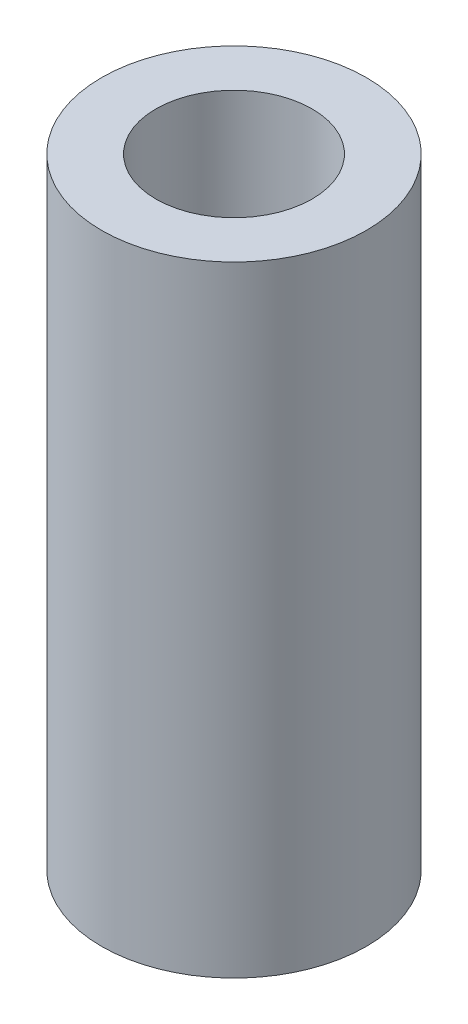
ISO-10303-21;
HEADER;
FILE_DESCRIPTION(('STEP AP214'),'2;1');
FILE_NAME('part.step','',(''),(''),'','','');
FILE_SCHEMA(('AUTOMOTIVE_DESIGN { 1 0 10303 214 1 1 1 1 }'));
ENDSEC;
DATA;
#1=APPLICATION_CONTEXT('core data for automotive mechanical design processes');
#2=APPLICATION_PROTOCOL_DEFINITION('international standard','automotive_design',2000,#1);
#3=PRODUCT_CONTEXT('',#1,'mechanical');
#4=PRODUCT('Part','Part','',(#3));
#5=PRODUCT_RELATED_PRODUCT_CATEGORY('part','',(#4));
#6=PRODUCT_DEFINITION_FORMATION('','',#4);
#7=PRODUCT_DEFINITION_CONTEXT('part definition',#1,'design');
#8=PRODUCT_DEFINITION('design','',#6,#7);
#9=PRODUCT_DEFINITION_SHAPE('','',#8);
#10=(LENGTH_UNIT() NAMED_UNIT(*) SI_UNIT(.MILLI.,.METRE.));
#11=(NAMED_UNIT(*) PLANE_ANGLE_UNIT() SI_UNIT($,.RADIAN.));
#12=(NAMED_UNIT(*) SI_UNIT($,.STERADIAN.) SOLID_ANGLE_UNIT());
#13=UNCERTAINTY_MEASURE_WITH_UNIT(LENGTH_MEASURE(1.E-05),#10,'distance_accuracy_value','');
#14=(GEOMETRIC_REPRESENTATION_CONTEXT(3) GLOBAL_UNCERTAINTY_ASSIGNED_CONTEXT((#13)) GLOBAL_UNIT_ASSIGNED_CONTEXT((#10,
#11,#12)) REPRESENTATION_CONTEXT('',''));
#15=CARTESIAN_POINT('',(0.,0.,0.));
#16=DIRECTION('',(0.,0.,1.));
#17=DIRECTION('',(1.,0.,0.));
#18=AXIS2_PLACEMENT_3D('',#15,#16,#17);
#19=CARTESIAN_POINT('',(0.,28.575,0.));
#20=DIRECTION('',(0.,1.,0.));
#21=DIRECTION('',(0.,0.,1.));
#22=AXIS2_PLACEMENT_3D('',#19,#20,#21);
#23=PLANE('',#22);
#24=CARTESIAN_POINT('',(0.,28.575,0.));
#25=DIRECTION('',(0.,1.,0.));
#26=DIRECTION('',(0.,0.,1.));
#27=AXIS2_PLACEMENT_3D('',#24,#25,#26);
#28=CIRCLE('',#27,6.1);
#29=CARTESIAN_POINT('',(0.,28.575,6.1));
#30=VERTEX_POINT('',#29);
#31=EDGE_CURVE('E10',#30,#30,#28,.T.);
#32=ORIENTED_EDGE('',*,*,#31,.T.);
#33=EDGE_LOOP('',(#32));
#34=FACE_BOUND('',#33,.T.);
#35=CARTESIAN_POINT('',(0.,28.575,0.));
#36=DIRECTION('',(0.,1.,0.));
#37=DIRECTION('',(0.,0.,1.));
#38=AXIS2_PLACEMENT_3D('',#35,#36,#37);
#39=CIRCLE('',#38,3.6);
#40=CARTESIAN_POINT('',(0.,28.575,3.6));
#41=VERTEX_POINT('',#40);
#42=EDGE_CURVE('E48',#41,#41,#39,.T.);
#43=ORIENTED_EDGE('',*,*,#42,.F.);
#44=EDGE_LOOP('',(#43));
#45=FACE_BOUND('',#44,.T.);
#46=ADVANCED_FACE('F37',(#34,#45),#23,.T.);
#47=CARTESIAN_POINT('',(0.,0.,0.));
#48=DIRECTION('',(0.,1.,0.));
#49=DIRECTION('',(0.,0.,1.));
#50=AXIS2_PLACEMENT_3D('',#47,#48,#49);
#51=PLANE('',#50);
#52=CARTESIAN_POINT('',(0.,0.,0.));
#53=DIRECTION('',(0.,1.,0.));
#54=DIRECTION('',(0.,0.,1.));
#55=AXIS2_PLACEMENT_3D('',#52,#53,#54);
#56=CIRCLE('',#55,6.1);
#57=CARTESIAN_POINT('',(0.,0.,6.1));
#58=VERTEX_POINT('',#57);
#59=EDGE_CURVE('E41',#58,#58,#56,.T.);
#60=ORIENTED_EDGE('',*,*,#59,.F.);
#61=EDGE_LOOP('',(#60));
#62=FACE_BOUND('',#61,.T.);
#63=CARTESIAN_POINT('',(0.,0.,0.));
#64=DIRECTION('',(0.,1.,0.));
#65=DIRECTION('',(0.,0.,1.));
#66=AXIS2_PLACEMENT_3D('',#63,#64,#65);
#67=CIRCLE('',#66,3.6);
#68=CARTESIAN_POINT('',(0.,0.,3.6));
#69=VERTEX_POINT('',#68);
#70=EDGE_CURVE('E50',#69,#69,#67,.T.);
#71=ORIENTED_EDGE('',*,*,#70,.T.);
#72=EDGE_LOOP('',(#71));
#73=FACE_BOUND('',#72,.T.);
#74=ADVANCED_FACE('F60',(#62,#73),#51,.F.);
#75=CARTESIAN_POINT('',(0.,28.575,0.));
#76=DIRECTION('',(0.,-1.,0.));
#77=DIRECTION('',(0.,0.,-1.));
#78=AXIS2_PLACEMENT_3D('',#75,#76,#77);
#79=CYLINDRICAL_SURFACE('',#78,6.1);
#80=ORIENTED_EDGE('',*,*,#31,.F.);
#81=EDGE_LOOP('',(#80));
#82=FACE_BOUND('',#81,.T.);
#83=ORIENTED_EDGE('',*,*,#59,.T.);
#84=EDGE_LOOP('',(#83));
#85=FACE_BOUND('',#84,.T.);
#86=ADVANCED_FACE('F39',(#82,#85),#79,.T.);
#87=CARTESIAN_POINT('',(0.,28.575,0.));
#88=DIRECTION('',(0.,-1.,0.));
#89=DIRECTION('',(0.,0.,-1.));
#90=AXIS2_PLACEMENT_3D('',#87,#88,#89);
#91=CYLINDRICAL_SURFACE('',#90,3.6);
#92=ORIENTED_EDGE('',*,*,#42,.T.);
#93=EDGE_LOOP('',(#92));
#94=FACE_BOUND('',#93,.T.);
#95=ORIENTED_EDGE('',*,*,#70,.F.);
#96=EDGE_LOOP('',(#95));
#97=FACE_BOUND('',#96,.T.);
#98=ADVANCED_FACE('F56',(#94,#97),#91,.F.);
#99=CLOSED_SHELL('',(#46,#74,#86,#98));
#100=MANIFOLD_SOLID_BREP('B2',#99);
#101=ADVANCED_BREP_SHAPE_REPRESENTATION('',(#18,#100),#14);
#102=SHAPE_DEFINITION_REPRESENTATION(#9,#101);
ENDSEC;
END-ISO-10303-21;
